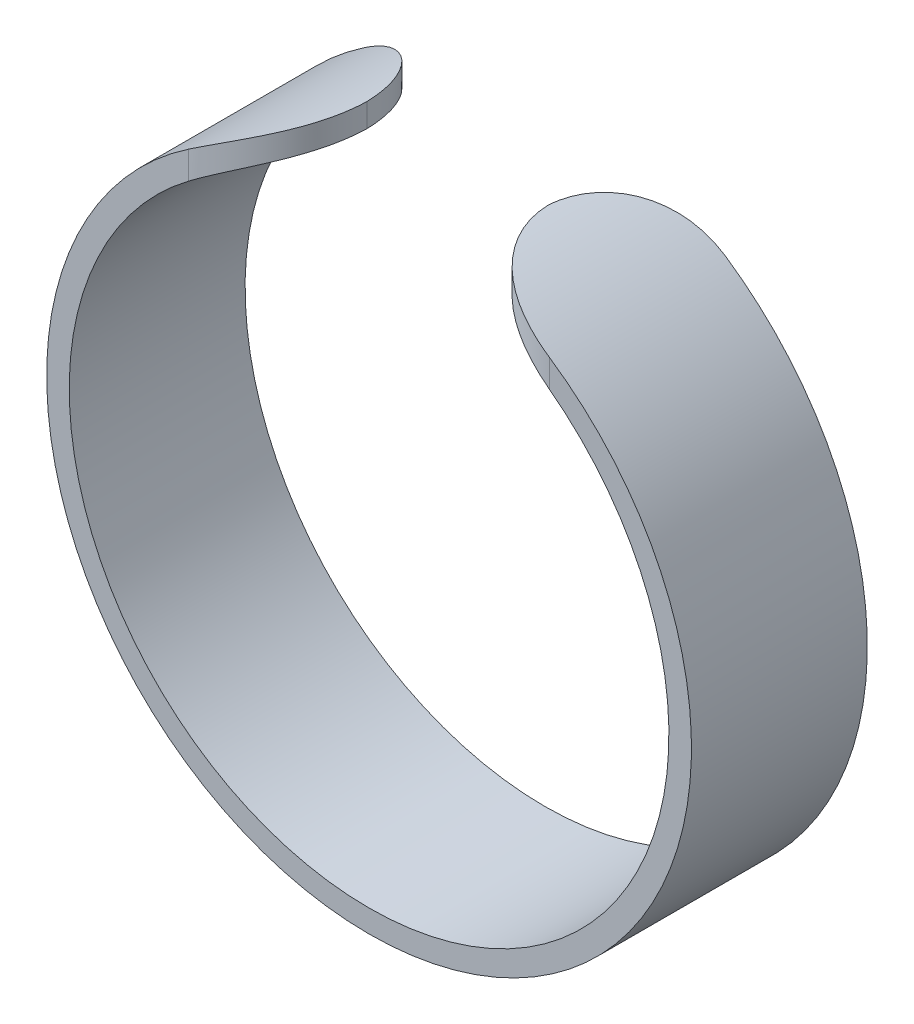
ISO-10303-21;
HEADER;
FILE_DESCRIPTION(('STEP AP214'),'2;1');
FILE_NAME('part.step','',(''),(''),'','','');
FILE_SCHEMA(('AUTOMOTIVE_DESIGN { 1 0 10303 214 1 1 1 1 }'));
ENDSEC;
DATA;
#1=APPLICATION_CONTEXT('core data for automotive mechanical design processes');
#2=APPLICATION_PROTOCOL_DEFINITION('international standard','automotive_design',2000,#1);
#3=PRODUCT_CONTEXT('',#1,'mechanical');
#4=PRODUCT('Part','Part','',(#3));
#5=PRODUCT_RELATED_PRODUCT_CATEGORY('part','',(#4));
#6=PRODUCT_DEFINITION_FORMATION('','',#4);
#7=PRODUCT_DEFINITION_CONTEXT('part definition',#1,'design');
#8=PRODUCT_DEFINITION('design','',#6,#7);
#9=PRODUCT_DEFINITION_SHAPE('','',#8);
#10=(LENGTH_UNIT() NAMED_UNIT(*) SI_UNIT(.MILLI.,.METRE.));
#11=(NAMED_UNIT(*) PLANE_ANGLE_UNIT() SI_UNIT($,.RADIAN.));
#12=(NAMED_UNIT(*) SI_UNIT($,.STERADIAN.) SOLID_ANGLE_UNIT());
#13=UNCERTAINTY_MEASURE_WITH_UNIT(LENGTH_MEASURE(1.E-05),#10,'distance_accuracy_value','');
#14=(GEOMETRIC_REPRESENTATION_CONTEXT(3) GLOBAL_UNCERTAINTY_ASSIGNED_CONTEXT((#13)) GLOBAL_UNIT_ASSIGNED_CONTEXT((#10,
#11,#12)) REPRESENTATION_CONTEXT('',''));
#15=CARTESIAN_POINT('',(0.,0.,0.));
#16=DIRECTION('',(0.,0.,1.));
#17=DIRECTION('',(1.,0.,0.));
#18=AXIS2_PLACEMENT_3D('',#15,#16,#17);
#19=CARTESIAN_POINT('',(0.,0.,7.8));
#20=DIRECTION('',(0.,0.,-1.));
#21=DIRECTION('',(-1.,0.,0.));
#22=AXIS2_PLACEMENT_3D('',#19,#20,#21);
#23=CYLINDRICAL_SURFACE('',#22,13.3);
#24=CARTESIAN_POINT('',(8.,10.6249705881946,7.8));
#25=CARTESIAN_POINT('',(7.88957742472824,10.7081349457774,7.80000447948558));
#26=CARTESIAN_POINT('',(7.77779764840667,10.7895791931144,7.79542630670732));
#27=CARTESIAN_POINT('',(7.55221358588623,10.9486533782295,7.7764690191143));
#28=CARTESIAN_POINT('',(7.43840740663884,11.0262794636793,7.76208021487277));
#29=CARTESIAN_POINT('',(7.20887927261541,11.1777065354743,7.72272588923175));
#30=CARTESIAN_POINT('',(7.09314947768669,11.2514768469223,7.69768683415423));
#31=CARTESIAN_POINT('',(6.86165409172559,11.3941288492624,7.63646932967754));
#32=CARTESIAN_POINT('',(6.7458885218635,11.4630120008271,7.6002942260216));
#33=CARTESIAN_POINT('',(6.51474100166893,11.5959494988396,7.51607790663079));
#34=CARTESIAN_POINT('',(6.39936691924318,11.6599681008088,7.4679582200376));
#35=CARTESIAN_POINT('',(6.17124951916395,11.7822929326605,7.35971971900797));
#36=CARTESIAN_POINT('',(6.05850584928526,11.8405999307384,7.29960252151709));
#37=CARTESIAN_POINT('',(5.83759162975482,11.9510554325436,7.16756460195597));
#38=CARTESIAN_POINT('',(5.72940662784355,12.0032245147517,7.0956853720918));
#39=CARTESIAN_POINT('',(5.5188485543258,12.1014794942201,6.94022335865102));
#40=CARTESIAN_POINT('',(5.41647425192188,12.147566682482,6.85664306664302));
#41=CARTESIAN_POINT('',(5.23367995206371,12.2273068912786,6.69142631466463));
#42=CARTESIAN_POINT('',(5.15224467355016,12.2617918644131,6.61130962945984));
#43=CARTESIAN_POINT('',(4.99576691328947,12.3263731919266,6.44343432543227));
#44=CARTESIAN_POINT('',(4.92072368169998,12.3564700613637,6.35567660541809));
#45=CARTESIAN_POINT('',(4.77789269501598,12.4123983108854,6.17307216517293));
#46=CARTESIAN_POINT('',(4.71010993976175,12.4382267581325,6.07822063524385));
#47=CARTESIAN_POINT('',(4.58268842116591,12.4857355798475,5.88222041734962));
#48=CARTESIAN_POINT('',(4.52304911917807,12.5074162287083,5.78107214652544));
#49=CARTESIAN_POINT('',(4.41714156866758,12.5451886881378,5.58179697521282));
#50=CARTESIAN_POINT('',(4.37017937759707,12.5615921727394,5.48409694546837));
#51=CARTESIAN_POINT('',(4.28420098495259,12.5911750814528,5.28479436571382));
#52=CARTESIAN_POINT('',(4.24518428883426,12.6043547062348,5.18319205905784));
#53=CARTESIAN_POINT('',(4.17552097448319,12.6276036573947,4.97694295878714));
#54=CARTESIAN_POINT('',(4.14486487218344,12.6376765097379,4.87229976511493));
#55=CARTESIAN_POINT('',(4.09216879918183,12.6548377247498,4.66066525797873));
#56=CARTESIAN_POINT('',(4.07012578764682,12.6619271407824,4.55367478733067));
#57=CARTESIAN_POINT('',(4.03503433055265,12.6731548422902,4.3391920367994));
#58=CARTESIAN_POINT('',(4.0218971180554,12.6773222669683,4.23171579241958));
#59=CARTESIAN_POINT('',(4.0043799471098,12.6828606328143,4.0161595719241));
#60=CARTESIAN_POINT('',(3.99998556543248,12.6842361798761,3.9080808856177));
#61=CARTESIAN_POINT('',(4.,12.684242192579,3.8));
#62=B_SPLINE_CURVE_WITH_KNOTS('',3,(#24,#25,#26,#27,#28,#29,#30,#31,#32,#33,#34,#35,#36,#37,#38,
#39,#40,#41,#42,#43,#44,#45,#46,#47,#48,#49,#50,#51,#52,#53,#54,#55,#56,#57,#58,#59,#60,#61),
.UNSPECIFIED.,.F.,.F.,(4,2,2,2,2,2,2,2,2,2,2,2,2,2,2,2,2,2,4),(0.,0.414691630814302,
0.829793424392656,1.24780900088213,1.66569911006173,2.08641081599856,2.5070658594249,
2.92626776661069,3.34538054631836,3.70289427687096,4.06036601004681,4.41808235031905,
4.77577501807908,5.10428227885724,5.43276908639708,5.76088170123205,6.08887837172288,
6.41355573692659,6.73769702954612),.UNSPECIFIED.);
#63=CARTESIAN_POINT('',(8.,10.6249705881946,7.8));
#64=VERTEX_POINT('',#63);
#65=CARTESIAN_POINT('',(4.00125019537356,12.6838478733397,3.90000000000001));
#66=VERTEX_POINT('',#65);
#67=EDGE_CURVE('E102',#64,#66,#62,.T.);
#68=ORIENTED_EDGE('',*,*,#67,.T.);
#69=CARTESIAN_POINT('',(4.,12.6842421925789,4.));
#70=CARTESIAN_POINT('',(3.9999858044884,12.6842363385974,3.89250920002083));
#71=CARTESIAN_POINT('',(4.00433225030041,12.6828756849861,3.78502008218207));
#72=CARTESIAN_POINT('',(4.02164426119455,12.6774023311921,3.57081424963331));
#73=CARTESIAN_POINT('',(4.03460936621885,12.6732897779037,3.46409749400254));
#74=CARTESIAN_POINT('',(4.06903725053389,12.6622763605302,3.25231252346559));
#75=CARTESIAN_POINT('',(4.09049049051054,12.6553786263673,3.14724259512447));
#76=CARTESIAN_POINT('',(4.14169267404116,12.6387147621957,2.93937777422368));
#77=CARTESIAN_POINT('',(4.17144150731842,12.6289486703171,2.83658285144102));
#78=CARTESIAN_POINT('',(4.23896889406326,12.6064430817222,2.63396469281326));
#79=CARTESIAN_POINT('',(4.27674990272403,12.5937026757309,2.53414237626463));
#80=CARTESIAN_POINT('',(4.35999251612553,12.5651263986018,2.33816873336285));
#81=CARTESIAN_POINT('',(4.40545693816583,12.5492893916887,2.24201876947409));
#82=CARTESIAN_POINT('',(4.50359375236643,12.5144057827252,2.05414026562356));
#83=CARTESIAN_POINT('',(4.55626263679064,12.4953607415767,1.9624096031861));
#84=CARTESIAN_POINT('',(4.66832980724953,12.453925705979,1.78390347224508));
#85=CARTESIAN_POINT('',(4.72773056426247,12.4315344823243,1.69712984094497));
#86=CARTESIAN_POINT('',(4.85285906386949,12.3832252869576,1.52886025255504));
#87=CARTESIAN_POINT('',(4.91860650904297,12.3572962222455,1.447382135857));
#88=CARTESIAN_POINT('',(5.05563352859656,12.3018711536777,1.29046840989888));
#89=CARTESIAN_POINT('',(5.12691511039501,12.2723738533165,1.21503501361581));
#90=CARTESIAN_POINT('',(5.27423634859639,12.2097839023304,1.07069381421629));
#91=CARTESIAN_POINT('',(5.3502726008663,12.1766938117638,1.00178142920767));
#92=CARTESIAN_POINT('',(5.50641315615274,12.1068885926232,0.870713482185539));
#93=CARTESIAN_POINT('',(5.58651891264457,12.0701721643728,0.808560359577378));
#94=CARTESIAN_POINT('',(5.83658352254935,11.9523529334993,0.629180917032903));
#95=CARTESIAN_POINT('',(6.01200465625223,11.8653611322758,0.523196534650525));
#96=CARTESIAN_POINT('',(6.37069614863769,11.676701667918,0.341318412381788));
#97=CARTESIAN_POINT('',(6.55398055211467,11.5750069046752,0.265481228590131));
#98=CARTESIAN_POINT('',(6.84443879569172,11.4043395610904,0.168908492455022));
#99=CARTESIAN_POINT('',(6.95105157126464,11.3396952565602,0.138429953847218));
#100=CARTESIAN_POINT('',(7.16406162361366,11.2063371988692,0.0867901953656164));
#101=CARTESIAN_POINT('',(7.27045880733033,11.1376219662452,0.0656323867047297));
#102=CARTESIAN_POINT('',(7.48179018398558,10.9967664370177,0.0322718453204754));
#103=CARTESIAN_POINT('',(7.58672828655765,10.9246394843179,0.020036872201884));
#104=CARTESIAN_POINT('',(7.79482581069748,10.7771529166399,0.00390365650234945));
#105=CARTESIAN_POINT('',(7.89798674206633,10.7017962567691,-2.04779051373261E-06));
#106=CARTESIAN_POINT('',(8.,10.6249705881946,0.));
#107=B_SPLINE_CURVE_WITH_KNOTS('',3,(#69,#70,#71,#72,#73,#74,#75,#76,#77,#78,#79,#80,#81,#82,
#83,#84,#85,#86,#87,#88,#89,#90,#91,#92,#93,#94,#95,#96,#97,#98,#99,#100,#101,#102,#103,#104,
#105,#106),.UNSPECIFIED.,.F.,.F.,(4,2,2,2,2,2,2,2,2,2,2,2,2,2,2,2,2,2,4),(0.,0.322373588882992,
0.644729971077422,0.966725100315815,1.2887159493456,1.61080536311925,1.93301313562299,
2.25506458509893,2.57723463090938,2.9004391149636,3.22376138892858,3.54685477166473,
3.87006437393607,4.53496493090889,5.20110701941109,5.58580098011153,5.97063561488186,
6.35407276370063,6.73716626872994),.UNSPECIFIED.);
#108=CARTESIAN_POINT('',(8.,10.6249705881946,0.));
#109=VERTEX_POINT('',#108);
#110=EDGE_CURVE('E97',#66,#109,#107,.T.);
#111=ORIENTED_EDGE('',*,*,#110,.T.);
#112=CARTESIAN_POINT('',(0.,0.,0.));
#113=DIRECTION('',(0.,0.,-1.));
#114=DIRECTION('',(1.,0.,0.));
#115=AXIS2_PLACEMENT_3D('',#112,#113,#114);
#116=CIRCLE('',#115,13.3);
#117=CARTESIAN_POINT('',(-8.,10.6249705881946,0.));
#118=VERTEX_POINT('',#117);
#119=EDGE_CURVE('E99',#109,#118,#116,.T.);
#120=ORIENTED_EDGE('',*,*,#119,.T.);
#121=CARTESIAN_POINT('',(-8.00000000000001,10.6249705881946,0.));
#122=CARTESIAN_POINT('',(-7.88957742472824,10.7081349457774,-4.47948557584867E-06));
#123=CARTESIAN_POINT('',(-7.77779764840668,10.7895791931144,0.00457369329268404));
#124=CARTESIAN_POINT('',(-7.55221358588623,10.9486533782295,0.0235309808857019));
#125=CARTESIAN_POINT('',(-7.43840740663884,11.0262794636793,0.0379197851272266));
#126=CARTESIAN_POINT('',(-7.20887927261542,11.1777065354743,0.0772741107682541));
#127=CARTESIAN_POINT('',(-7.09314947768669,11.2514768469223,0.102313165845766));
#128=CARTESIAN_POINT('',(-6.86165409172559,11.3941288492624,0.163530670322457));
#129=CARTESIAN_POINT('',(-6.7458885218635,11.4630120008271,0.199705773978405));
#130=CARTESIAN_POINT('',(-6.51474100166893,11.5959494988396,0.283922093369214));
#131=CARTESIAN_POINT('',(-6.39936691924319,11.6599681008088,0.3320417799624));
#132=CARTESIAN_POINT('',(-6.17124951916395,11.7822929326605,0.440280280992035));
#133=CARTESIAN_POINT('',(-6.05850584928526,11.8405999307384,0.500397478482912));
#134=CARTESIAN_POINT('',(-5.83759162975482,11.9510554325436,0.632435398044031));
#135=CARTESIAN_POINT('',(-5.72940662784355,12.0032245147517,0.7043146279082));
#136=CARTESIAN_POINT('',(-5.51884855432579,12.1014794942201,0.859776641348978));
#137=CARTESIAN_POINT('',(-5.41647425192188,12.147566682482,0.943356933356985));
#138=CARTESIAN_POINT('',(-5.23367995206371,12.2273068912786,1.10857368533538));
#139=CARTESIAN_POINT('',(-5.15224467355016,12.2617918644131,1.18869037054017));
#140=CARTESIAN_POINT('',(-4.99576691328948,12.3263731919266,1.35656567456774));
#141=CARTESIAN_POINT('',(-4.92072368169998,12.3564700613637,1.44432339458191));
#142=CARTESIAN_POINT('',(-4.77789269501598,12.4123983108854,1.62692783482707));
#143=CARTESIAN_POINT('',(-4.71010993976175,12.4382267581325,1.72177936475615));
#144=CARTESIAN_POINT('',(-4.58268842116591,12.4857355798475,1.91777958265038));
#145=CARTESIAN_POINT('',(-4.52304911917807,12.5074162287083,2.01892785347456));
#146=CARTESIAN_POINT('',(-4.41714156866758,12.5451886881378,2.21820302478719));
#147=CARTESIAN_POINT('',(-4.37017937759707,12.5615921727394,2.31590305453164));
#148=CARTESIAN_POINT('',(-4.28420098495259,12.5911750814528,2.51520563428619));
#149=CARTESIAN_POINT('',(-4.24518428883426,12.6043547062348,2.61680794094217));
#150=CARTESIAN_POINT('',(-4.17552097448319,12.6276036573947,2.82305704121286));
#151=CARTESIAN_POINT('',(-4.14486487218344,12.6376765097379,2.92770023488507));
#152=CARTESIAN_POINT('',(-4.09216879918183,12.6548377247498,3.13933474202128));
#153=CARTESIAN_POINT('',(-4.07012578764682,12.6619271407824,3.24632521266934));
#154=CARTESIAN_POINT('',(-4.03503433055265,12.6731548422902,3.46080796320061));
#155=CARTESIAN_POINT('',(-4.0218971180554,12.6773222669683,3.56828420758042));
#156=CARTESIAN_POINT('',(-4.00437994710981,12.6828606328143,3.7838404280759));
#157=CARTESIAN_POINT('',(-3.99998556543248,12.6842361798761,3.8919191143823));
#158=CARTESIAN_POINT('',(-4.,12.684242192579,4.));
#159=B_SPLINE_CURVE_WITH_KNOTS('',3,(#121,#122,#123,#124,#125,#126,#127,#128,#129,#130,#131,
#132,#133,#134,#135,#136,#137,#138,#139,#140,#141,#142,#143,#144,#145,#146,#147,#148,#149,#150,
#151,#152,#153,#154,#155,#156,#157,#158),.UNSPECIFIED.,.F.,.F.,(4,2,2,2,2,2,2,2,2,2,2,2,2,2,2,2,
2,2,4),(0.,0.414691630814302,0.829793424392659,1.24780900088213,1.66569911006173,
2.08641081599857,2.5070658594249,2.9262677666107,3.34538054631837,3.70289427687097,
4.06036601004682,4.41808235031905,4.77577501807909,5.10428227885725,5.43276908639709,
5.76088170123206,6.0888783717229,6.41355573692659,6.73769702954613),.UNSPECIFIED.);
#160=CARTESIAN_POINT('',(-4.00125019537356,12.6838478733397,3.89999999999998));
#161=VERTEX_POINT('',#160);
#162=EDGE_CURVE('E176',#118,#161,#159,.T.);
#163=ORIENTED_EDGE('',*,*,#162,.T.);
#164=CARTESIAN_POINT('',(-4.,12.6842421925789,3.8));
#165=CARTESIAN_POINT('',(-3.9999858044884,12.6842363385974,3.90749079997917));
#166=CARTESIAN_POINT('',(-4.00433225030042,12.6828756849861,4.01497991781793));
#167=CARTESIAN_POINT('',(-4.02164426119456,12.6774023311921,4.22918575036669));
#168=CARTESIAN_POINT('',(-4.03460936621885,12.6732897779037,4.33590250599746));
#169=CARTESIAN_POINT('',(-4.06903725053389,12.6622763605302,4.54768747653441));
#170=CARTESIAN_POINT('',(-4.09049049051054,12.6553786263673,4.65275740487553));
#171=CARTESIAN_POINT('',(-4.14169267404116,12.6387147621957,4.86062222577632));
#172=CARTESIAN_POINT('',(-4.17144150731843,12.6289486703171,4.96341714855897));
#173=CARTESIAN_POINT('',(-4.23896889406326,12.6064430817222,5.16603530718674));
#174=CARTESIAN_POINT('',(-4.27674990272404,12.5937026757309,5.26585762373537));
#175=CARTESIAN_POINT('',(-4.35999251612553,12.5651263986018,5.46183126663715));
#176=CARTESIAN_POINT('',(-4.40545693816584,12.5492893916887,5.55798123052591));
#177=CARTESIAN_POINT('',(-4.50359375236643,12.5144057827252,5.74585973437644));
#178=CARTESIAN_POINT('',(-4.55626263679065,12.4953607415767,5.8375903968139));
#179=CARTESIAN_POINT('',(-4.66832980724953,12.453925705979,6.01609652775491));
#180=CARTESIAN_POINT('',(-4.72773056426248,12.4315344823243,6.10287015905503));
#181=CARTESIAN_POINT('',(-4.8528590638695,12.3832252869576,6.27113974744496));
#182=CARTESIAN_POINT('',(-4.91860650904297,12.3572962222455,6.352617864143));
#183=CARTESIAN_POINT('',(-5.05563352859656,12.3018711536777,6.50953159010111));
#184=CARTESIAN_POINT('',(-5.12691511039502,12.2723738533165,6.58496498638419));
#185=CARTESIAN_POINT('',(-5.27423634859639,12.2097839023304,6.7293061857837));
#186=CARTESIAN_POINT('',(-5.3502726008663,12.1766938117638,6.79821857079233));
#187=CARTESIAN_POINT('',(-5.50641315615274,12.1068885926232,6.92928651781446));
#188=CARTESIAN_POINT('',(-5.58651891264457,12.0701721643728,6.99143964042262));
#189=CARTESIAN_POINT('',(-5.83658352254935,11.9523529334993,7.1708190829671));
#190=CARTESIAN_POINT('',(-6.01200465625224,11.8653611322758,7.27680346534947));
#191=CARTESIAN_POINT('',(-6.3706961486377,11.676701667918,7.45868158761821));
#192=CARTESIAN_POINT('',(-6.55398055211467,11.5750069046752,7.53451877140987));
#193=CARTESIAN_POINT('',(-6.84443879569172,11.4043395610904,7.63109150754498));
#194=CARTESIAN_POINT('',(-6.95105157126465,11.3396952565602,7.66157004615278));
#195=CARTESIAN_POINT('',(-7.16406162361367,11.2063371988692,7.71320980463438));
#196=CARTESIAN_POINT('',(-7.27045880733033,11.1376219662452,7.73436761329527));
#197=CARTESIAN_POINT('',(-7.48179018398559,10.9967664370177,7.76772815467952));
#198=CARTESIAN_POINT('',(-7.58672828655765,10.9246394843179,7.77996312779811));
#199=CARTESIAN_POINT('',(-7.79482581069749,10.7771529166399,7.79609634349765));
#200=CARTESIAN_POINT('',(-7.89798674206633,10.7017962567691,7.80000204779051));
#201=CARTESIAN_POINT('',(-8.,10.6249705881946,7.8));
#202=B_SPLINE_CURVE_WITH_KNOTS('',3,(#164,#165,#166,#167,#168,#169,#170,#171,#172,#173,#174,
#175,#176,#177,#178,#179,#180,#181,#182,#183,#184,#185,#186,#187,#188,#189,#190,#191,#192,#193,
#194,#195,#196,#197,#198,#199,#200,#201),.UNSPECIFIED.,.F.,.F.,(4,2,2,2,2,2,2,2,2,2,2,2,2,2,2,2,
2,2,4),(0.,0.322373588882993,0.644729971077421,0.966725100315814,1.2887159493456,
1.61080536311926,1.93301313562299,2.25506458509893,2.57723463090938,2.9004391149636,
3.22376138892857,3.54685477166473,3.87006437393607,4.53496493090889,5.20110701941108,
5.58580098011153,5.97063561488186,6.35407276370062,6.73716626872994),.UNSPECIFIED.);
#203=CARTESIAN_POINT('',(-8.,10.6249705881946,7.8));
#204=VERTEX_POINT('',#203);
#205=EDGE_CURVE('E184',#161,#204,#202,.T.);
#206=ORIENTED_EDGE('',*,*,#205,.T.);
#207=CARTESIAN_POINT('',(0.,0.,7.8));
#208=DIRECTION('',(0.,0.,-1.));
#209=DIRECTION('',(1.,0.,0.));
#210=AXIS2_PLACEMENT_3D('',#207,#208,#209);
#211=CIRCLE('',#210,13.3);
#212=EDGE_CURVE('E192',#64,#204,#211,.T.);
#213=ORIENTED_EDGE('',*,*,#212,.F.);
#214=EDGE_LOOP('',(#68,#111,#120,#163,#206,#213));
#215=FACE_BOUND('',#214,.T.);
#216=ADVANCED_FACE('F41',(#215),#23,.F.);
#217=CARTESIAN_POINT('',(0.,0.,7.8));
#218=DIRECTION('',(0.,0.,-1.));
#219=DIRECTION('',(-1.,0.,0.));
#220=AXIS2_PLACEMENT_3D('',#217,#218,#219);
#221=CYLINDRICAL_SURFACE('',#220,14.3);
#222=CARTESIAN_POINT('',(0.,0.,0.));
#223=DIRECTION('',(0.,0.,1.));
#224=DIRECTION('',(1.,0.,0.));
#225=AXIS2_PLACEMENT_3D('',#222,#223,#224);
#226=CIRCLE('',#225,14.3);
#227=CARTESIAN_POINT('',(-8.,11.852847759083,0.));
#228=VERTEX_POINT('',#227);
#229=CARTESIAN_POINT('',(8.,11.852847759083,0.));
#230=VERTEX_POINT('',#229);
#231=EDGE_CURVE('E118',#228,#230,#226,.T.);
#232=ORIENTED_EDGE('',*,*,#231,.T.);
#233=CARTESIAN_POINT('',(8.,11.852847759083,0.));
#234=CARTESIAN_POINT('',(7.88905936785157,11.9277458003986,-5.96708883709881E-06));
#235=CARTESIAN_POINT('',(7.77701519459547,12.001082941538,0.00461638177105253));
#236=CARTESIAN_POINT('',(7.55142238218729,12.1442893120355,0.0236207062589851));
#237=CARTESIAN_POINT('',(7.437872565175,12.2141555952328,0.0380108261107138));
#238=CARTESIAN_POINT('',(7.20951642487816,12.3503308974725,0.0771655316169383));
#239=CARTESIAN_POINT('',(7.09470662695817,12.4166176160694,0.101988206898852));
#240=CARTESIAN_POINT('',(6.86550458410622,12.5448026750246,0.162427671591007));
#241=CARTESIAN_POINT('',(6.75111223933893,12.606702140121,0.198041682040612));
#242=CARTESIAN_POINT('',(6.52321732652796,12.7261258724514,0.28060730051294));
#243=CARTESIAN_POINT('',(6.40972348558516,12.7836233319169,0.327622070151695));
#244=CARTESIAN_POINT('',(6.18560399008542,12.8935596479729,0.433026784623675));
#245=CARTESIAN_POINT('',(6.07497803617726,12.9459990340944,0.491415536774939));
#246=CARTESIAN_POINT('',(5.8582931141323,13.0454811035954,0.619338017283487));
#247=CARTESIAN_POINT('',(5.75222212420602,13.0925386179379,0.688839786607126));
#248=CARTESIAN_POINT('',(5.54576976965634,13.1813149092513,0.838825258197616));
#249=CARTESIAN_POINT('',(5.4453874525706,13.2230345814245,0.91930711431859));
#250=CARTESIAN_POINT('',(5.26369972148632,13.2963095908814,1.08015169455083));
#251=CARTESIAN_POINT('',(5.18156888917323,13.3284839160948,1.15930325238342));
#252=CARTESIAN_POINT('',(5.02370310229807,13.3887843496509,1.32516165952572));
#253=CARTESIAN_POINT('',(4.94796752530277,13.4169108521456,1.41186777189789));
#254=CARTESIAN_POINT('',(4.80371350336945,13.469232738116,1.59228294691941));
#255=CARTESIAN_POINT('',(4.73519932771604,13.4934258006806,1.68599609678309));
#256=CARTESIAN_POINT('',(4.60622617284233,13.5379960934594,1.87966227952382));
#257=CARTESIAN_POINT('',(4.54576672041637,13.5583735478647,1.97961494532944));
#258=CARTESIAN_POINT('',(4.43756621007305,13.5941538994176,2.17767096489751));
#259=CARTESIAN_POINT('',(4.38922744745441,13.6098070031124,2.27540332248998));
#260=CARTESIAN_POINT('',(4.30056178364359,13.6380839817376,2.47485537790565));
#261=CARTESIAN_POINT('',(4.26023443397813,13.6507080262407,2.57657485215096));
#262=CARTESIAN_POINT('',(4.18801185215058,13.6730386912953,2.78315700650254));
#263=CARTESIAN_POINT('',(4.15610803843587,13.6827482823636,2.88801636557995));
#264=CARTESIAN_POINT('',(4.10098471204397,13.6993703229512,3.1001716838166));
#265=CARTESIAN_POINT('',(4.07776230448543,13.706283704951,3.20746681806604));
#266=CARTESIAN_POINT('',(4.03937385309086,13.7176493386445,3.42853891256863));
#267=CARTESIAN_POINT('',(4.02461064109669,13.7219788850563,3.54239234394606));
#268=CARTESIAN_POINT('',(4.00492271086649,13.7277313947246,3.77083162297617));
#269=CARTESIAN_POINT('',(3.99998196431118,13.7291590933077,3.88541597082032));
#270=CARTESIAN_POINT('',(4.,13.7291660343955,4.));
#271=B_SPLINE_CURVE_WITH_KNOTS('',3,(#233,#234,#235,#236,#237,#238,#239,#240,#241,#242,#243,
#244,#245,#246,#247,#248,#249,#250,#251,#252,#253,#254,#255,#256,#257,#258,#259,#260,#261,#262,
#263,#264,#265,#266,#267,#268,#269,#270),.UNSPECIFIED.,.F.,.F.,(4,2,2,2,2,2,2,2,2,2,2,2,2,2,2,2,
2,2,4),(0.,0.401537562191115,0.803410332408036,1.20755105751202,1.61158779751678,
2.01791625319057,2.42420212395634,2.82933993628417,3.23440971419113,3.58948721670003,
3.9445301205302,4.2997817616863,4.65501252300726,4.98506695666708,5.31510290890136,
5.64480132526279,5.97438970288938,6.3185906149349,6.66222939669056),.UNSPECIFIED.);
#272=CARTESIAN_POINT('',(4.00125019537356,13.728801727537,3.9));
#273=VERTEX_POINT('',#272);
#274=EDGE_CURVE('E60',#230,#273,#271,.T.);
#275=ORIENTED_EDGE('',*,*,#274,.T.);
#276=CARTESIAN_POINT('',(4.,13.7291660343955,3.8));
#277=CARTESIAN_POINT('',(3.99998605253377,13.7291604356197,3.90818134782343));
#278=CARTESIAN_POINT('',(4.0043881104994,13.7278872527653,4.01636100574337));
#279=CARTESIAN_POINT('',(4.02192382445057,13.7227651391862,4.23194343237025));
#280=CARTESIAN_POINT('',(4.03505702028177,13.7189163442031,4.33934624171766));
#281=CARTESIAN_POINT('',(4.06993589050884,13.7086079691365,4.55249858554998));
#282=CARTESIAN_POINT('',(4.09167230677556,13.7021511954079,4.65824977064238));
#283=CARTESIAN_POINT('',(4.14355924278908,13.6865501489262,4.86746332096503));
#284=CARTESIAN_POINT('',(4.17370965191083,13.6774059115069,4.97092571626842));
#285=CARTESIAN_POINT('',(4.24216393106802,13.6563291394127,5.17486031008676));
#286=CARTESIAN_POINT('',(4.28047028708306,13.6443957544809,5.27533158622442));
#287=CARTESIAN_POINT('',(4.36489467941173,13.6176229638226,5.4725793917578));
#288=CARTESIAN_POINT('',(4.41101558288201,13.6027824911728,5.5693545490203));
#289=CARTESIAN_POINT('',(4.51060462996615,13.5700843575825,5.75845172165968));
#290=CARTESIAN_POINT('',(4.5640691268217,13.5522281932015,5.85077591678876));
#291=CARTESIAN_POINT('',(4.67787865178716,13.5133662258808,6.03043070921941));
#292=CARTESIAN_POINT('',(4.73822620582094,13.4923592657749,6.11775945553895));
#293=CARTESIAN_POINT('',(4.86538971989874,13.4470275344643,6.28705800820689));
#294=CARTESIAN_POINT('',(4.93222340609924,13.4226935922774,6.36901204113495));
#295=CARTESIAN_POINT('',(5.0715965880646,13.370656058831,6.52681889842867));
#296=CARTESIAN_POINT('',(5.14413816076976,13.3429512389813,6.60266948142389));
#297=CARTESIAN_POINT('',(5.29417031794426,13.284134897861,6.74777288715014));
#298=CARTESIAN_POINT('',(5.37165769169768,13.2530255775362,6.81702991895872));
#299=CARTESIAN_POINT('',(5.53089876363058,13.1873651676,6.94868734036314));
#300=CARTESIAN_POINT('',(5.61265397839971,13.1528128504909,7.01108526775529));
#301=CARTESIAN_POINT('',(5.86751078213666,13.0421259187953,7.19062044019068));
#302=CARTESIAN_POINT('',(6.04636329164441,12.9604344824581,7.29641399898016));
#303=CARTESIAN_POINT('',(6.41273836012444,12.7831236646727,7.47729070579074));
#304=CARTESIAN_POINT('',(6.60027407989685,12.6874826351187,7.5523254172197));
#305=CARTESIAN_POINT('',(6.89044374510889,12.5309675847978,7.64450675869705));
#306=CARTESIAN_POINT('',(6.99219808516862,12.4744912019892,7.6723721146354));
#307=CARTESIAN_POINT('',(7.19578664562959,12.3581705415366,7.71971365624654));
#308=CARTESIAN_POINT('',(7.29762087925613,12.298325467911,7.73918784969988));
#309=CARTESIAN_POINT('',(7.5003125422222,12.1757662752735,7.76998631829136));
#310=CARTESIAN_POINT('',(7.60117207077028,12.1130621150362,7.78133688054212));
#311=CARTESIAN_POINT('',(7.8016414617897,11.9849323076855,7.79634250206794));
#312=CARTESIAN_POINT('',(7.90125208487963,11.9195084333699,7.80000249651678));
#313=CARTESIAN_POINT('',(8.,11.852847759083,7.8));
#314=B_SPLINE_CURVE_WITH_KNOTS('',3,(#276,#277,#278,#279,#280,#281,#282,#283,#284,#285,#286,
#287,#288,#289,#290,#291,#292,#293,#294,#295,#296,#297,#298,#299,#300,#301,#302,#303,#304,#305,
#306,#307,#308,#309,#310,#311,#312,#313),.UNSPECIFIED.,.F.,.F.,(4,2,2,2,2,2,2,2,2,2,2,2,2,2,2,2,
2,2,4),(0.,0.324444653120106,0.648872208493891,0.972951584802374,1.29702670039702,
1.62120073772887,1.94549397306082,2.26962674580833,2.59387885289528,2.9190435075139,
3.24432703253175,3.56940149642111,3.89459227340178,4.56134523829801,5.22914415643808,
5.58784789281299,5.94663674532467,6.3042592847939,6.66165226136194),.UNSPECIFIED.);
#315=CARTESIAN_POINT('',(8.,11.852847759083,7.8));
#316=VERTEX_POINT('',#315);
#317=EDGE_CURVE('E152',#273,#316,#314,.T.);
#318=ORIENTED_EDGE('',*,*,#317,.T.);
#319=CARTESIAN_POINT('',(0.,0.,7.8));
#320=DIRECTION('',(0.,0.,1.));
#321=DIRECTION('',(1.,0.,0.));
#322=AXIS2_PLACEMENT_3D('',#319,#320,#321);
#323=CIRCLE('',#322,14.3);
#324=CARTESIAN_POINT('',(-8.,11.852847759083,7.8));
#325=VERTEX_POINT('',#324);
#326=EDGE_CURVE('E190',#325,#316,#323,.T.);
#327=ORIENTED_EDGE('',*,*,#326,.F.);
#328=CARTESIAN_POINT('',(-8.,11.852847759083,7.8));
#329=CARTESIAN_POINT('',(-7.88905936785157,11.9277458003986,7.80000596708884));
#330=CARTESIAN_POINT('',(-7.77701519459547,12.001082941538,7.79538361822895));
#331=CARTESIAN_POINT('',(-7.55142238218729,12.1442893120355,7.77637929374101));
#332=CARTESIAN_POINT('',(-7.43787256517501,12.2141555952328,7.76198917388928));
#333=CARTESIAN_POINT('',(-7.20951642487816,12.3503308974725,7.72283446838306));
#334=CARTESIAN_POINT('',(-7.09470662695817,12.4166176160694,7.69801179310115));
#335=CARTESIAN_POINT('',(-6.86550458410622,12.5448026750246,7.63757232840899));
#336=CARTESIAN_POINT('',(-6.75111223933893,12.606702140121,7.60195831795939));
#337=CARTESIAN_POINT('',(-6.52321732652796,12.7261258724514,7.51939269948706));
#338=CARTESIAN_POINT('',(-6.40972348558516,12.7836233319169,7.4723779298483));
#339=CARTESIAN_POINT('',(-6.18560399008542,12.8935596479729,7.36697321537632));
#340=CARTESIAN_POINT('',(-6.07497803617726,12.9459990340944,7.30858446322506));
#341=CARTESIAN_POINT('',(-5.85829311413231,13.0454811035954,7.18066198271651));
#342=CARTESIAN_POINT('',(-5.75222212420602,13.0925386179379,7.11116021339287));
#343=CARTESIAN_POINT('',(-5.54576976965634,13.1813149092513,6.96117474180238));
#344=CARTESIAN_POINT('',(-5.4453874525706,13.2230345814245,6.88069288568141));
#345=CARTESIAN_POINT('',(-5.26369972148632,13.2963095908814,6.71984830544916));
#346=CARTESIAN_POINT('',(-5.18156888917323,13.3284839160948,6.64069674761658));
#347=CARTESIAN_POINT('',(-5.02370310229807,13.3887843496509,6.47483834047427));
#348=CARTESIAN_POINT('',(-4.94796752530277,13.4169108521456,6.3881322281021));
#349=CARTESIAN_POINT('',(-4.80371350336945,13.469232738116,6.20771705308058));
#350=CARTESIAN_POINT('',(-4.73519932771603,13.4934258006806,6.11400390321691));
#351=CARTESIAN_POINT('',(-4.60622617284233,13.5379960934594,5.92033772047617));
#352=CARTESIAN_POINT('',(-4.54576672041637,13.5583735478647,5.82038505467056));
#353=CARTESIAN_POINT('',(-4.43756621007305,13.5941538994176,5.62232903510249));
#354=CARTESIAN_POINT('',(-4.38922744745441,13.6098070031124,5.52459667751001));
#355=CARTESIAN_POINT('',(-4.30056178364359,13.6380839817376,5.32514462209435));
#356=CARTESIAN_POINT('',(-4.26023443397813,13.6507080262407,5.22342514784904));
#357=CARTESIAN_POINT('',(-4.18801185215058,13.6730386912953,5.01684299349745));
#358=CARTESIAN_POINT('',(-4.15610803843587,13.6827482823636,4.91198363442005));
#359=CARTESIAN_POINT('',(-4.10098471204397,13.6993703229512,4.69982831618339));
#360=CARTESIAN_POINT('',(-4.07776230448544,13.706283704951,4.59253318193396));
#361=CARTESIAN_POINT('',(-4.03937385309087,13.7176493386445,4.37146108743137));
#362=CARTESIAN_POINT('',(-4.02461064109669,13.7219788850563,4.25760765605394));
#363=CARTESIAN_POINT('',(-4.00492271086649,13.7277313947246,4.02916837702383));
#364=CARTESIAN_POINT('',(-3.99998196431118,13.7291590933077,3.91458402917968));
#365=CARTESIAN_POINT('',(-4.,13.7291660343955,3.8));
#366=B_SPLINE_CURVE_WITH_KNOTS('',3,(#328,#329,#330,#331,#332,#333,#334,#335,#336,#337,#338,
#339,#340,#341,#342,#343,#344,#345,#346,#347,#348,#349,#350,#351,#352,#353,#354,#355,#356,#357,
#358,#359,#360,#361,#362,#363,#364,#365),.UNSPECIFIED.,.F.,.F.,(4,2,2,2,2,2,2,2,2,2,2,2,2,2,2,2,
2,2,4),(0.,0.401537562191117,0.803410332408037,1.20755105751202,1.61158779751678,
2.01791625319058,2.42420212395635,2.82933993628417,3.23440971419114,3.58948721670004,
3.9445301205302,4.29978176168631,4.65501252300727,4.98506695666708,5.31510290890137,
5.6448013252628,5.97438970288938,6.31859061493491,6.66222939669056),.UNSPECIFIED.);
#367=CARTESIAN_POINT('',(-4.00125019537356,13.728801727537,3.9));
#368=VERTEX_POINT('',#367);
#369=EDGE_CURVE('E67',#325,#368,#366,.T.);
#370=ORIENTED_EDGE('',*,*,#369,.T.);
#371=CARTESIAN_POINT('',(-4.,13.7291660343955,4.));
#372=CARTESIAN_POINT('',(-3.99998605253377,13.7291604356197,3.89181865217657));
#373=CARTESIAN_POINT('',(-4.00438811049941,13.7278872527653,3.78363899425663));
#374=CARTESIAN_POINT('',(-4.02192382445057,13.7227651391862,3.56805656762975));
#375=CARTESIAN_POINT('',(-4.03505702028177,13.7189163442031,3.46065375828234));
#376=CARTESIAN_POINT('',(-4.06993589050884,13.7086079691365,3.24750141445002));
#377=CARTESIAN_POINT('',(-4.09167230677556,13.7021511954079,3.14175022935762));
#378=CARTESIAN_POINT('',(-4.14355924278909,13.6865501489262,2.93253667903497));
#379=CARTESIAN_POINT('',(-4.17370965191083,13.6774059115069,2.82907428373158));
#380=CARTESIAN_POINT('',(-4.24216393106803,13.6563291394127,2.62513968991324));
#381=CARTESIAN_POINT('',(-4.28047028708306,13.6443957544809,2.52466841377558));
#382=CARTESIAN_POINT('',(-4.36489467941173,13.6176229638226,2.3274206082422));
#383=CARTESIAN_POINT('',(-4.41101558288201,13.6027824911728,2.2306454509797));
#384=CARTESIAN_POINT('',(-4.51060462996615,13.5700843575825,2.04154827834032));
#385=CARTESIAN_POINT('',(-4.5640691268217,13.5522281932015,1.94922408321124));
#386=CARTESIAN_POINT('',(-4.67787865178716,13.5133662258808,1.76956929078059));
#387=CARTESIAN_POINT('',(-4.73822620582094,13.4923592657749,1.68224054446105));
#388=CARTESIAN_POINT('',(-4.86538971989874,13.4470275344643,1.5129419917931));
#389=CARTESIAN_POINT('',(-4.93222340609924,13.4226935922774,1.43098795886505));
#390=CARTESIAN_POINT('',(-5.0715965880646,13.370656058831,1.27318110157134));
#391=CARTESIAN_POINT('',(-5.14413816076976,13.3429512389813,1.19733051857611));
#392=CARTESIAN_POINT('',(-5.29417031794426,13.284134897861,1.05222711284985));
#393=CARTESIAN_POINT('',(-5.37165769169768,13.2530255775362,0.982970081041276));
#394=CARTESIAN_POINT('',(-5.53089876363059,13.1873651676,0.851312659636857));
#395=CARTESIAN_POINT('',(-5.61265397839971,13.1528128504909,0.78891473224471));
#396=CARTESIAN_POINT('',(-5.86751078213666,13.0421259187953,0.609379559809322));
#397=CARTESIAN_POINT('',(-6.04636329164441,12.9604344824581,0.503586001019834));
#398=CARTESIAN_POINT('',(-6.41273836012444,12.7831236646727,0.322709294209262));
#399=CARTESIAN_POINT('',(-6.60027407989686,12.6874826351187,0.247674582780304));
#400=CARTESIAN_POINT('',(-6.89044374510889,12.5309675847978,0.155493241302946));
#401=CARTESIAN_POINT('',(-6.99219808516862,12.4744912019892,0.1276278853646));
#402=CARTESIAN_POINT('',(-7.19578664562959,12.3581705415365,0.080286343753458));
#403=CARTESIAN_POINT('',(-7.29762087925614,12.298325467911,0.0608121503001157));
#404=CARTESIAN_POINT('',(-7.50031254222221,12.1757662752735,0.0300136817086443));
#405=CARTESIAN_POINT('',(-7.60117207077028,12.1130621150362,0.0186631194578837));
#406=CARTESIAN_POINT('',(-7.80164146178971,11.9849323076855,0.00365749793205605));
#407=CARTESIAN_POINT('',(-7.90125208487963,11.9195084333699,-2.49651677606679E-06));
#408=CARTESIAN_POINT('',(-8.,11.852847759083,0.));
#409=B_SPLINE_CURVE_WITH_KNOTS('',3,(#371,#372,#373,#374,#375,#376,#377,#378,#379,#380,#381,
#382,#383,#384,#385,#386,#387,#388,#389,#390,#391,#392,#393,#394,#395,#396,#397,#398,#399,#400,
#401,#402,#403,#404,#405,#406,#407,#408),.UNSPECIFIED.,.F.,.F.,(4,2,2,2,2,2,2,2,2,2,2,2,2,2,2,2,
2,2,4),(0.,0.324444653120107,0.648872208493891,0.972951584802374,1.29702670039702,
1.62120073772887,1.94549397306082,2.26962674580833,2.59387885289528,2.9190435075139,
3.24432703253175,3.56940149642111,3.89459227340178,4.56134523829801,5.22914415643808,
5.58784789281299,5.94663674532467,6.30425928479391,6.66165226136195),.UNSPECIFIED.);
#410=EDGE_CURVE('E126',#368,#228,#409,.T.);
#411=ORIENTED_EDGE('',*,*,#410,.T.);
#412=EDGE_LOOP('',(#232,#275,#318,#327,#370,#411));
#413=FACE_BOUND('',#412,.T.);
#414=ADVANCED_FACE('F139',(#413),#221,.T.);
#415=CARTESIAN_POINT('',(0.,0.,7.8));
#416=DIRECTION('',(0.,0.,1.));
#417=DIRECTION('',(1.,0.,0.));
#418=AXIS2_PLACEMENT_3D('',#415,#416,#417);
#419=PLANE('',#418);
#420=ORIENTED_EDGE('',*,*,#326,.T.);
#421=DIRECTION('',(0.,-1.,0.));
#422=VECTOR('',#421,1.);
#423=CARTESIAN_POINT('',(8.,12.6842421925789,7.8));
#424=LINE('',#423,#422);
#425=EDGE_CURVE('E11',#316,#64,#424,.T.);
#426=ORIENTED_EDGE('',*,*,#425,.T.);
#427=ORIENTED_EDGE('',*,*,#212,.T.);
#428=DIRECTION('',(0.,1.,0.));
#429=VECTOR('',#428,1.);
#430=CARTESIAN_POINT('',(-8.,13.7291660343955,7.8));
#431=LINE('',#430,#429);
#432=EDGE_CURVE('E52',#204,#325,#431,.T.);
#433=ORIENTED_EDGE('',*,*,#432,.T.);
#434=EDGE_LOOP('',(#420,#426,#427,#433));
#435=FACE_BOUND('',#434,.T.);
#436=ADVANCED_FACE('F144',(#435),#419,.T.);
#437=CARTESIAN_POINT('',(0.,0.,0.));
#438=DIRECTION('',(0.,0.,1.));
#439=DIRECTION('',(1.,0.,0.));
#440=AXIS2_PLACEMENT_3D('',#437,#438,#439);
#441=PLANE('',#440);
#442=ORIENTED_EDGE('',*,*,#119,.F.);
#443=DIRECTION('',(0.,-1.,0.));
#444=VECTOR('',#443,1.);
#445=CARTESIAN_POINT('',(8.,0.,0.));
#446=LINE('',#445,#444);
#447=EDGE_CURVE('E115',#109,#230,#446,.F.);
#448=ORIENTED_EDGE('',*,*,#447,.T.);
#449=ORIENTED_EDGE('',*,*,#231,.F.);
#450=DIRECTION('',(0.,1.,0.));
#451=VECTOR('',#450,1.);
#452=CARTESIAN_POINT('',(-8.00000000000001,0.,0.));
#453=LINE('',#452,#451);
#454=EDGE_CURVE('E108',#228,#118,#453,.F.);
#455=ORIENTED_EDGE('',*,*,#454,.T.);
#456=EDGE_LOOP('',(#442,#448,#449,#455));
#457=FACE_BOUND('',#456,.T.);
#458=ADVANCED_FACE('F113',(#457),#441,.F.);
#459=CARTESIAN_POINT('',(8.,0.,3.8));
#460=DIRECTION('',(0.,1.,0.));
#461=DIRECTION('',(0.,0.,1.));
#462=AXIS2_PLACEMENT_3D('',#459,#460,#461);
#463=CYLINDRICAL_SURFACE('',#462,4.);
#464=ORIENTED_EDGE('',*,*,#425,.F.);
#465=ORIENTED_EDGE('',*,*,#317,.F.);
#466=DIRECTION('',(0.,1.,0.));
#467=VECTOR('',#466,1.);
#468=CARTESIAN_POINT('',(4.00125019537356,12.1770683112951,3.9));
#469=LINE('',#468,#467);
#470=EDGE_CURVE('E119',#66,#273,#469,.T.);
#471=ORIENTED_EDGE('',*,*,#470,.F.);
#472=ORIENTED_EDGE('',*,*,#67,.F.);
#473=EDGE_LOOP('',(#464,#465,#471,#472));
#474=FACE_BOUND('',#473,.T.);
#475=ADVANCED_FACE('F162',(#474),#463,.T.);
#476=CARTESIAN_POINT('',(8.,13.7291660343955,4.));
#477=DIRECTION('',(0.,-1.,0.));
#478=DIRECTION('',(0.,0.,-1.));
#479=AXIS2_PLACEMENT_3D('',#476,#477,#478);
#480=CYLINDRICAL_SURFACE('',#479,4.);
#481=ORIENTED_EDGE('',*,*,#274,.F.);
#482=ORIENTED_EDGE('',*,*,#447,.F.);
#483=ORIENTED_EDGE('',*,*,#110,.F.);
#484=ORIENTED_EDGE('',*,*,#470,.T.);
#485=EDGE_LOOP('',(#481,#482,#483,#484));
#486=FACE_BOUND('',#485,.T.);
#487=ADVANCED_FACE('F121',(#486),#480,.T.);
#488=CARTESIAN_POINT('',(-8.00000000000001,0.,3.8));
#489=DIRECTION('',(0.,-1.,0.));
#490=DIRECTION('',(1.,0.,0.));
#491=AXIS2_PLACEMENT_3D('',#488,#489,#490);
#492=CYLINDRICAL_SURFACE('',#491,4.);
#493=ORIENTED_EDGE('',*,*,#432,.F.);
#494=ORIENTED_EDGE('',*,*,#205,.F.);
#495=DIRECTION('',(0.,-1.,0.));
#496=VECTOR('',#495,1.);
#497=CARTESIAN_POINT('',(-4.00125019537356,12.1770683112951,3.9));
#498=LINE('',#497,#496);
#499=EDGE_CURVE('E46',#368,#161,#498,.T.);
#500=ORIENTED_EDGE('',*,*,#499,.F.);
#501=ORIENTED_EDGE('',*,*,#369,.F.);
#502=EDGE_LOOP('',(#493,#494,#500,#501));
#503=FACE_BOUND('',#502,.T.);
#504=ADVANCED_FACE('F43',(#503),#492,.T.);
#505=CARTESIAN_POINT('',(-8.,13.7291660343955,4.));
#506=DIRECTION('',(0.,1.,0.));
#507=DIRECTION('',(-1.,0.,0.));
#508=AXIS2_PLACEMENT_3D('',#505,#506,#507);
#509=CYLINDRICAL_SURFACE('',#508,4.);
#510=ORIENTED_EDGE('',*,*,#162,.F.);
#511=ORIENTED_EDGE('',*,*,#454,.F.);
#512=ORIENTED_EDGE('',*,*,#410,.F.);
#513=ORIENTED_EDGE('',*,*,#499,.T.);
#514=EDGE_LOOP('',(#510,#511,#512,#513));
#515=FACE_BOUND('',#514,.T.);
#516=ADVANCED_FACE('F167',(#515),#509,.T.);
#517=CLOSED_SHELL('',(#216,#414,#436,#458,#475,#487,#504,#516));
#518=MANIFOLD_SOLID_BREP('B2',#517);
#519=ADVANCED_BREP_SHAPE_REPRESENTATION('',(#18,#518),#14);
#520=SHAPE_DEFINITION_REPRESENTATION(#9,#519);
ENDSEC;
END-ISO-10303-21;
